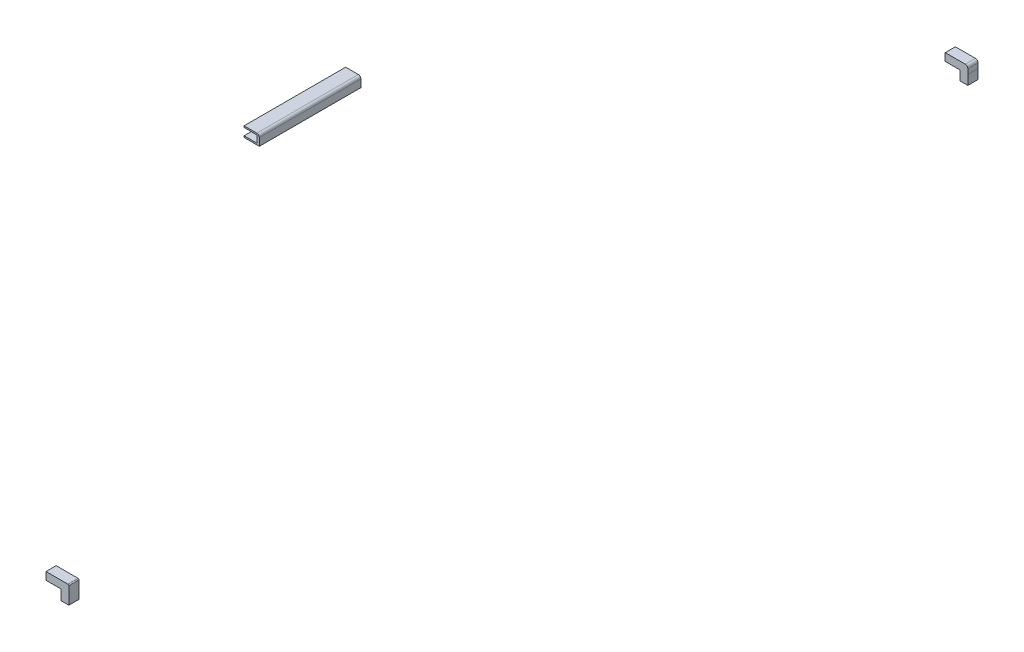
ISO-10303-21;
HEADER;
FILE_DESCRIPTION(('STEP AP214'),'2;1');
FILE_NAME('part.step','',(''),(''),'','','');
FILE_SCHEMA(('AUTOMOTIVE_DESIGN { 1 0 10303 214 1 1 1 1 }'));
ENDSEC;
DATA;
#1=APPLICATION_CONTEXT('core data for automotive mechanical design processes');
#2=APPLICATION_PROTOCOL_DEFINITION('international standard','automotive_design',2000,#1);
#3=PRODUCT_CONTEXT('',#1,'mechanical');
#4=PRODUCT('Part','Part','',(#3));
#5=PRODUCT_RELATED_PRODUCT_CATEGORY('part','',(#4));
#6=PRODUCT_DEFINITION_FORMATION('','',#4);
#7=PRODUCT_DEFINITION_CONTEXT('part definition',#1,'design');
#8=PRODUCT_DEFINITION('design','',#6,#7);
#9=PRODUCT_DEFINITION_SHAPE('','',#8);
#10=(LENGTH_UNIT() NAMED_UNIT(*) SI_UNIT(.MILLI.,.METRE.));
#11=(NAMED_UNIT(*) PLANE_ANGLE_UNIT() SI_UNIT($,.RADIAN.));
#12=(NAMED_UNIT(*) SI_UNIT($,.STERADIAN.) SOLID_ANGLE_UNIT());
#13=UNCERTAINTY_MEASURE_WITH_UNIT(LENGTH_MEASURE(1.E-05),#10,'distance_accuracy_value','');
#14=(GEOMETRIC_REPRESENTATION_CONTEXT(3) GLOBAL_UNCERTAINTY_ASSIGNED_CONTEXT((#13)) GLOBAL_UNIT_ASSIGNED_CONTEXT((#10,
#11,#12)) REPRESENTATION_CONTEXT('',''));
#15=CARTESIAN_POINT('',(0.,0.,0.));
#16=DIRECTION('',(0.,0.,1.));
#17=DIRECTION('',(1.,0.,0.));
#18=AXIS2_PLACEMENT_3D('',#15,#16,#17);
#19=CARTESIAN_POINT('',(0.,-860.,0.));
#20=DIRECTION('',(0.,1.,0.));
#21=DIRECTION('',(0.,0.,1.));
#22=AXIS2_PLACEMENT_3D('',#19,#20,#21);
#23=PLANE('',#22);
#24=DIRECTION('',(0.,0.,-1.));
#25=VECTOR('',#24,1.);
#26=CARTESIAN_POINT('',(-160.,-860.,950.));
#27=LINE('',#26,#25);
#28=CARTESIAN_POINT('',(-160.,-860.,1050.));
#29=VERTEX_POINT('',#28);
#30=CARTESIAN_POINT('',(-160.,-860.,850.));
#31=VERTEX_POINT('',#30);
#32=EDGE_CURVE('P0_E10',#29,#31,#27,.T.);
#33=ORIENTED_EDGE('',*,*,#32,.F.);
#34=DIRECTION('',(1.,0.,0.));
#35=VECTOR('',#34,1.);
#36=CARTESIAN_POINT('',(-175.,-860.,1050.));
#37=LINE('',#36,#35);
#38=CARTESIAN_POINT('',(-190.,-860.,1050.));
#39=VERTEX_POINT('',#38);
#40=EDGE_CURVE('P0_E132',#39,#29,#37,.T.);
#41=ORIENTED_EDGE('',*,*,#40,.F.);
#42=DIRECTION('',(0.,0.,1.));
#43=VECTOR('',#42,1.);
#44=CARTESIAN_POINT('',(-190.,-860.,950.));
#45=LINE('',#44,#43);
#46=CARTESIAN_POINT('',(-190.,-860.,850.));
#47=VERTEX_POINT('',#46);
#48=EDGE_CURVE('P0_E287',#47,#39,#45,.T.);
#49=ORIENTED_EDGE('',*,*,#48,.F.);
#50=DIRECTION('',(-1.,0.,0.));
#51=VECTOR('',#50,1.);
#52=CARTESIAN_POINT('',(-175.000000000001,-860.,850.));
#53=LINE('',#52,#51);
#54=EDGE_CURVE('P0_E27',#31,#47,#53,.T.);
#55=ORIENTED_EDGE('',*,*,#54,.F.);
#56=EDGE_LOOP('',(#33,#41,#49,#55));
#57=FACE_BOUND('',#56,.T.);
#58=ADVANCED_FACE('P0_F16',(#57),#23,.F.);
#59=CARTESIAN_POINT('',(-190.,-860.,850.));
#60=DIRECTION('',(-1.,0.,0.));
#61=DIRECTION('',(0.,0.,1.));
#62=AXIS2_PLACEMENT_3D('',#59,#60,#61);
#63=PLANE('',#62);
#64=DIRECTION('',(0.,0.,-1.));
#65=VECTOR('',#64,1.);
#66=CARTESIAN_POINT('',(-190.,-857.,950.));
#67=LINE('',#66,#65);
#68=CARTESIAN_POINT('',(-190.,-857.,1050.));
#69=VERTEX_POINT('',#68);
#70=CARTESIAN_POINT('',(-190.,-857.,850.));
#71=VERTEX_POINT('',#70);
#72=EDGE_CURVE('P0_E172',#69,#71,#67,.T.);
#73=ORIENTED_EDGE('',*,*,#72,.T.);
#74=DIRECTION('',(0.,1.,0.));
#75=VECTOR('',#74,1.);
#76=CARTESIAN_POINT('',(-190.,-858.5,850.));
#77=LINE('',#76,#75);
#78=EDGE_CURVE('P0_E188',#47,#71,#77,.T.);
#79=ORIENTED_EDGE('',*,*,#78,.F.);
#80=ORIENTED_EDGE('',*,*,#48,.T.);
#81=DIRECTION('',(0.,1.,0.));
#82=VECTOR('',#81,1.);
#83=CARTESIAN_POINT('',(-190.,-858.5,1050.));
#84=LINE('',#83,#82);
#85=EDGE_CURVE('P0_E123',#39,#69,#84,.T.);
#86=ORIENTED_EDGE('',*,*,#85,.T.);
#87=EDGE_LOOP('',(#73,#79,#80,#86));
#88=FACE_BOUND('',#87,.T.);
#89=ADVANCED_FACE('P0_F200',(#88),#63,.T.);
#90=CARTESIAN_POINT('',(-190.,-860.,850.));
#91=DIRECTION('',(-1.,0.,0.));
#92=DIRECTION('',(0.,0.,1.));
#93=AXIS2_PLACEMENT_3D('',#90,#91,#92);
#94=PLANE('',#93);
#95=DIRECTION('',(0.,0.,-1.));
#96=VECTOR('',#95,1.);
#97=CARTESIAN_POINT('',(-190.,-843.,950.));
#98=LINE('',#97,#96);
#99=CARTESIAN_POINT('',(-190.,-843.,1050.));
#100=VERTEX_POINT('',#99);
#101=CARTESIAN_POINT('',(-190.,-843.,850.));
#102=VERTEX_POINT('',#101);
#103=EDGE_CURVE('P0_E191',#100,#102,#98,.T.);
#104=ORIENTED_EDGE('',*,*,#103,.F.);
#105=DIRECTION('',(0.,1.,0.));
#106=VECTOR('',#105,1.);
#107=CARTESIAN_POINT('',(-190.,-841.5,1050.));
#108=LINE('',#107,#106);
#109=CARTESIAN_POINT('',(-190.,-840.,1050.));
#110=VERTEX_POINT('',#109);
#111=EDGE_CURVE('P0_E126',#100,#110,#108,.T.);
#112=ORIENTED_EDGE('',*,*,#111,.T.);
#113=DIRECTION('',(0.,0.,1.));
#114=VECTOR('',#113,1.);
#115=CARTESIAN_POINT('',(-190.,-840.,950.));
#116=LINE('',#115,#114);
#117=CARTESIAN_POINT('',(-190.,-840.,850.));
#118=VERTEX_POINT('',#117);
#119=EDGE_CURVE('P0_E167',#118,#110,#116,.T.);
#120=ORIENTED_EDGE('',*,*,#119,.F.);
#121=DIRECTION('',(0.,1.,0.));
#122=VECTOR('',#121,1.);
#123=CARTESIAN_POINT('',(-190.,-841.5,850.));
#124=LINE('',#123,#122);
#125=EDGE_CURVE('P0_E103',#102,#118,#124,.T.);
#126=ORIENTED_EDGE('',*,*,#125,.F.);
#127=EDGE_LOOP('',(#104,#112,#120,#126));
#128=FACE_BOUND('',#127,.T.);
#129=ADVANCED_FACE('P0_F194',(#128),#94,.T.);
#130=CARTESIAN_POINT('',(-165.,-857.,1050.));
#131=DIRECTION('',(0.,-1.,0.));
#132=DIRECTION('',(0.,0.,-1.));
#133=AXIS2_PLACEMENT_3D('',#130,#131,#132);
#134=PLANE('',#133);
#135=DIRECTION('',(1.,0.,0.));
#136=VECTOR('',#135,1.);
#137=CARTESIAN_POINT('',(-177.5,-857.,850.));
#138=LINE('',#137,#136);
#139=CARTESIAN_POINT('',(-165.,-857.,850.));
#140=VERTEX_POINT('',#139);
#141=EDGE_CURVE('P0_E169',#71,#140,#138,.T.);
#142=ORIENTED_EDGE('',*,*,#141,.F.);
#143=ORIENTED_EDGE('',*,*,#72,.F.);
#144=DIRECTION('',(1.,0.,0.));
#145=VECTOR('',#144,1.);
#146=CARTESIAN_POINT('',(-177.5,-857.,1050.));
#147=LINE('',#146,#145);
#148=CARTESIAN_POINT('',(-165.,-857.,1050.));
#149=VERTEX_POINT('',#148);
#150=EDGE_CURVE('P0_E153',#69,#149,#147,.T.);
#151=ORIENTED_EDGE('',*,*,#150,.T.);
#152=DIRECTION('',(0.,0.,-1.));
#153=VECTOR('',#152,1.);
#154=CARTESIAN_POINT('',(-165.,-857.,950.));
#155=LINE('',#154,#153);
#156=EDGE_CURVE('P0_E146',#149,#140,#155,.T.);
#157=ORIENTED_EDGE('',*,*,#156,.T.);
#158=EDGE_LOOP('',(#142,#143,#151,#157));
#159=FACE_BOUND('',#158,.T.);
#160=ADVANCED_FACE('P0_F201',(#159),#134,.F.);
#161=CARTESIAN_POINT('',(-165.,-857.,1050.));
#162=DIRECTION('',(-1.,0.,0.));
#163=DIRECTION('',(0.,0.,1.));
#164=AXIS2_PLACEMENT_3D('',#161,#162,#163);
#165=PLANE('',#164);
#166=DIRECTION('',(0.,1.,0.));
#167=VECTOR('',#166,1.);
#168=CARTESIAN_POINT('',(-165.,-850.,850.));
#169=LINE('',#168,#167);
#170=CARTESIAN_POINT('',(-165.,-843.,850.));
#171=VERTEX_POINT('',#170);
#172=EDGE_CURVE('P0_E150',#140,#171,#169,.T.);
#173=ORIENTED_EDGE('',*,*,#172,.F.);
#174=ORIENTED_EDGE('',*,*,#156,.F.);
#175=DIRECTION('',(0.,1.,0.));
#176=VECTOR('',#175,1.);
#177=CARTESIAN_POINT('',(-165.,-850.,1050.));
#178=LINE('',#177,#176);
#179=CARTESIAN_POINT('',(-165.,-843.,1050.));
#180=VERTEX_POINT('',#179);
#181=EDGE_CURVE('P0_E152',#149,#180,#178,.T.);
#182=ORIENTED_EDGE('',*,*,#181,.T.);
#183=DIRECTION('',(0.,0.,-1.));
#184=VECTOR('',#183,1.);
#185=CARTESIAN_POINT('',(-165.,-843.,950.));
#186=LINE('',#185,#184);
#187=EDGE_CURVE('P0_E134',#180,#171,#186,.T.);
#188=ORIENTED_EDGE('',*,*,#187,.T.);
#189=EDGE_LOOP('',(#173,#174,#182,#188));
#190=FACE_BOUND('',#189,.T.);
#191=ADVANCED_FACE('P0_F203',(#190),#165,.T.);
#192=CARTESIAN_POINT('',(-190.,-843.,1050.));
#193=DIRECTION('',(0.,1.,0.));
#194=DIRECTION('',(0.,0.,1.));
#195=AXIS2_PLACEMENT_3D('',#192,#193,#194);
#196=PLANE('',#195);
#197=DIRECTION('',(-1.,0.,0.));
#198=VECTOR('',#197,1.);
#199=CARTESIAN_POINT('',(-177.5,-843.,850.));
#200=LINE('',#199,#198);
#201=EDGE_CURVE('P0_E137',#171,#102,#200,.T.);
#202=ORIENTED_EDGE('',*,*,#201,.F.);
#203=ORIENTED_EDGE('',*,*,#187,.F.);
#204=DIRECTION('',(-1.,0.,0.));
#205=VECTOR('',#204,1.);
#206=CARTESIAN_POINT('',(-177.5,-843.,1050.));
#207=LINE('',#206,#205);
#208=EDGE_CURVE('P0_E154',#180,#100,#207,.T.);
#209=ORIENTED_EDGE('',*,*,#208,.T.);
#210=ORIENTED_EDGE('',*,*,#103,.T.);
#211=EDGE_LOOP('',(#202,#203,#209,#210));
#212=FACE_BOUND('',#211,.T.);
#213=ADVANCED_FACE('P0_F196',(#212),#196,.F.);
#214=CARTESIAN_POINT('',(-160.,-860.,1050.));
#215=DIRECTION('',(1.,0.,0.));
#216=DIRECTION('',(0.,0.,-1.));
#217=AXIS2_PLACEMENT_3D('',#214,#215,#216);
#218=PLANE('',#217);
#219=DIRECTION('',(0.,0.,-1.));
#220=VECTOR('',#219,1.);
#221=CARTESIAN_POINT('',(-160.,-845.,950.));
#222=LINE('',#221,#220);
#223=CARTESIAN_POINT('',(-160.,-845.,1050.));
#224=VERTEX_POINT('',#223);
#225=CARTESIAN_POINT('',(-160.,-845.,850.));
#226=VERTEX_POINT('',#225);
#227=EDGE_CURVE('P0_E110',#224,#226,#222,.T.);
#228=ORIENTED_EDGE('',*,*,#227,.F.);
#229=DIRECTION('',(0.,1.,0.));
#230=VECTOR('',#229,1.);
#231=CARTESIAN_POINT('',(-160.,-852.5,1050.));
#232=LINE('',#231,#230);
#233=EDGE_CURVE('P0_E122',#29,#224,#232,.T.);
#234=ORIENTED_EDGE('',*,*,#233,.F.);
#235=ORIENTED_EDGE('',*,*,#32,.T.);
#236=DIRECTION('',(0.,1.,0.));
#237=VECTOR('',#236,1.);
#238=CARTESIAN_POINT('',(-160.,-852.5,850.));
#239=LINE('',#238,#237);
#240=EDGE_CURVE('P0_E106',#31,#226,#239,.T.);
#241=ORIENTED_EDGE('',*,*,#240,.T.);
#242=EDGE_LOOP('',(#228,#234,#235,#241));
#243=FACE_BOUND('',#242,.T.);
#244=ADVANCED_FACE('P0_F133',(#243),#218,.T.);
#245=CARTESIAN_POINT('',(0.,-840.,0.));
#246=DIRECTION('',(0.,1.,0.));
#247=DIRECTION('',(0.,0.,1.));
#248=AXIS2_PLACEMENT_3D('',#245,#246,#247);
#249=PLANE('',#248);
#250=DIRECTION('',(0.,0.,-1.));
#251=VECTOR('',#250,1.);
#252=CARTESIAN_POINT('',(-165.,-840.,950.));
#253=LINE('',#252,#251);
#254=CARTESIAN_POINT('',(-165.,-840.,1050.));
#255=VERTEX_POINT('',#254);
#256=CARTESIAN_POINT('',(-165.,-840.,850.));
#257=VERTEX_POINT('',#256);
#258=EDGE_CURVE('P0_E84',#255,#257,#253,.T.);
#259=ORIENTED_EDGE('',*,*,#258,.T.);
#260=DIRECTION('',(-1.,0.,0.));
#261=VECTOR('',#260,1.);
#262=CARTESIAN_POINT('',(-177.5,-840.,850.));
#263=LINE('',#262,#261);
#264=EDGE_CURVE('P0_E91',#257,#118,#263,.T.);
#265=ORIENTED_EDGE('',*,*,#264,.T.);
#266=ORIENTED_EDGE('',*,*,#119,.T.);
#267=DIRECTION('',(1.,0.,0.));
#268=VECTOR('',#267,1.);
#269=CARTESIAN_POINT('',(-177.5,-840.,1050.));
#270=LINE('',#269,#268);
#271=EDGE_CURVE('P0_E93',#110,#255,#270,.T.);
#272=ORIENTED_EDGE('',*,*,#271,.T.);
#273=EDGE_LOOP('',(#259,#265,#266,#272));
#274=FACE_BOUND('',#273,.T.);
#275=ADVANCED_FACE('P0_F89',(#274),#249,.T.);
#276=CARTESIAN_POINT('',(-160.,-860.,1050.));
#277=DIRECTION('',(0.,0.,-1.));
#278=DIRECTION('',(-1.,0.,0.));
#279=AXIS2_PLACEMENT_3D('',#276,#277,#278);
#280=PLANE('',#279);
#281=ORIENTED_EDGE('',*,*,#233,.T.);
#282=CARTESIAN_POINT('',(-165.,-845.,1050.));
#283=DIRECTION('',(0.,0.,-1.));
#284=DIRECTION('',(-1.,0.,0.));
#285=AXIS2_PLACEMENT_3D('',#282,#283,#284);
#286=CIRCLE('',#285,5.);
#287=EDGE_CURVE('P0_E105',#255,#224,#286,.T.);
#288=ORIENTED_EDGE('',*,*,#287,.F.);
#289=ORIENTED_EDGE('',*,*,#271,.F.);
#290=ORIENTED_EDGE('',*,*,#111,.F.);
#291=ORIENTED_EDGE('',*,*,#208,.F.);
#292=ORIENTED_EDGE('',*,*,#181,.F.);
#293=ORIENTED_EDGE('',*,*,#150,.F.);
#294=ORIENTED_EDGE('',*,*,#85,.F.);
#295=ORIENTED_EDGE('',*,*,#40,.T.);
#296=EDGE_LOOP('',(#281,#288,#289,#290,#291,#292,#293,#294,#295));
#297=FACE_BOUND('',#296,.T.);
#298=ADVANCED_FACE('P0_F128',(#297),#280,.F.);
#299=CARTESIAN_POINT('',(-190.,-860.,850.));
#300=DIRECTION('',(0.,0.,1.));
#301=DIRECTION('',(1.,0.,0.));
#302=AXIS2_PLACEMENT_3D('',#299,#300,#301);
#303=PLANE('',#302);
#304=ORIENTED_EDGE('',*,*,#264,.F.);
#305=CARTESIAN_POINT('',(-165.,-845.,850.));
#306=DIRECTION('',(0.,0.,1.));
#307=DIRECTION('',(1.,0.,0.));
#308=AXIS2_PLACEMENT_3D('',#305,#306,#307);
#309=CIRCLE('',#308,5.);
#310=EDGE_CURVE('P0_E20',#226,#257,#309,.T.);
#311=ORIENTED_EDGE('',*,*,#310,.F.);
#312=ORIENTED_EDGE('',*,*,#240,.F.);
#313=ORIENTED_EDGE('',*,*,#54,.T.);
#314=ORIENTED_EDGE('',*,*,#78,.T.);
#315=ORIENTED_EDGE('',*,*,#141,.T.);
#316=ORIENTED_EDGE('',*,*,#172,.T.);
#317=ORIENTED_EDGE('',*,*,#201,.T.);
#318=ORIENTED_EDGE('',*,*,#125,.T.);
#319=EDGE_LOOP('',(#304,#311,#312,#313,#314,#315,#316,#317,#318));
#320=FACE_BOUND('',#319,.T.);
#321=ADVANCED_FACE('P0_F100',(#320),#303,.F.);
#322=CARTESIAN_POINT('',(-165.,-845.,950.));
#323=DIRECTION('',(0.,0.,1.));
#324=DIRECTION('',(1.,0.,0.));
#325=AXIS2_PLACEMENT_3D('',#322,#323,#324);
#326=CYLINDRICAL_SURFACE('',#325,5.);
#327=ORIENTED_EDGE('',*,*,#227,.T.);
#328=ORIENTED_EDGE('',*,*,#310,.T.);
#329=ORIENTED_EDGE('',*,*,#258,.F.);
#330=ORIENTED_EDGE('',*,*,#287,.T.);
#331=EDGE_LOOP('',(#327,#328,#329,#330));
#332=FACE_BOUND('',#331,.T.);
#333=ADVANCED_FACE('P0_F18',(#332),#326,.T.);
#334=CLOSED_SHELL('',(#58,#89,#129,#160,#191,#213,#244,#275,#298,#321,#333));
#335=MANIFOLD_SOLID_BREP('P0_B1',#334);
#336=CARTESIAN_POINT('',(400.,0.,0.));
#337=DIRECTION('',(1.,0.,0.));
#338=DIRECTION('',(0.,0.,-1.));
#339=AXIS2_PLACEMENT_3D('',#336,#337,#338);
#340=PLANE('',#339);
#341=DIRECTION('',(0.,0.,-1.));
#342=VECTOR('',#341,1.);
#343=CARTESIAN_POINT('',(400.,-880.,1990.));
#344=LINE('',#343,#342);
#345=CARTESIAN_POINT('',(400.,-880.,2000.));
#346=VERTEX_POINT('',#345);
#347=CARTESIAN_POINT('',(400.,-880.,1980.));
#348=VERTEX_POINT('',#347);
#349=EDGE_CURVE('P1_E11',#346,#348,#344,.T.);
#350=ORIENTED_EDGE('',*,*,#349,.F.);
#351=DIRECTION('',(0.,-1.,0.));
#352=VECTOR('',#351,1.);
#353=CARTESIAN_POINT('',(400.,-870.,2000.));
#354=LINE('',#353,#352);
#355=CARTESIAN_POINT('',(400.,-860.,2000.));
#356=VERTEX_POINT('',#355);
#357=EDGE_CURVE('P1_E144',#356,#346,#354,.T.);
#358=ORIENTED_EDGE('',*,*,#357,.F.);
#359=DIRECTION('',(0.,0.,1.));
#360=VECTOR('',#359,1.);
#361=CARTESIAN_POINT('',(400.,-860.,1990.));
#362=LINE('',#361,#360);
#363=CARTESIAN_POINT('',(400.,-860.,1980.));
#364=VERTEX_POINT('',#363);
#365=EDGE_CURVE('P1_E148',#364,#356,#362,.T.);
#366=ORIENTED_EDGE('',*,*,#365,.F.);
#367=DIRECTION('',(0.,1.,0.));
#368=VECTOR('',#367,1.);
#369=CARTESIAN_POINT('',(400.,-870.,1980.));
#370=LINE('',#369,#368);
#371=EDGE_CURVE('P1_E28',#348,#364,#370,.T.);
#372=ORIENTED_EDGE('',*,*,#371,.F.);
#373=EDGE_LOOP('',(#350,#358,#366,#372));
#374=FACE_BOUND('',#373,.T.);
#375=ADVANCED_FACE('P1_F17',(#374),#340,.F.);
#376=CARTESIAN_POINT('',(370.,-860.,2000.));
#377=DIRECTION('',(1.,0.,0.));
#378=DIRECTION('',(0.,0.,-1.));
#379=AXIS2_PLACEMENT_3D('',#376,#377,#378);
#380=PLANE('',#379);
#381=DIRECTION('',(0.,0.,1.));
#382=VECTOR('',#381,1.);
#383=CARTESIAN_POINT('',(370.,-845.,1990.));
#384=LINE('',#383,#382);
#385=CARTESIAN_POINT('',(370.,-845.,1980.));
#386=VERTEX_POINT('',#385);
#387=CARTESIAN_POINT('',(370.,-845.,2000.));
#388=VERTEX_POINT('',#387);
#389=EDGE_CURVE('P1_E85',#386,#388,#384,.T.);
#390=ORIENTED_EDGE('',*,*,#389,.F.);
#391=DIRECTION('',(0.,1.,0.));
#392=VECTOR('',#391,1.);
#393=CARTESIAN_POINT('',(370.,-852.5,1980.));
#394=LINE('',#393,#392);
#395=CARTESIAN_POINT('',(370.,-860.,1980.));
#396=VERTEX_POINT('',#395);
#397=EDGE_CURVE('P1_E134',#396,#386,#394,.T.);
#398=ORIENTED_EDGE('',*,*,#397,.F.);
#399=DIRECTION('',(0.,0.,1.));
#400=VECTOR('',#399,1.);
#401=CARTESIAN_POINT('',(370.,-860.,1990.));
#402=LINE('',#401,#400);
#403=CARTESIAN_POINT('',(370.,-860.,2000.));
#404=VERTEX_POINT('',#403);
#405=EDGE_CURVE('P1_E129',#396,#404,#402,.T.);
#406=ORIENTED_EDGE('',*,*,#405,.T.);
#407=DIRECTION('',(0.,1.,0.));
#408=VECTOR('',#407,1.);
#409=CARTESIAN_POINT('',(370.,-852.5,2000.));
#410=LINE('',#409,#408);
#411=EDGE_CURVE('P1_E88',#404,#388,#410,.T.);
#412=ORIENTED_EDGE('',*,*,#411,.T.);
#413=EDGE_LOOP('',(#390,#398,#406,#412));
#414=FACE_BOUND('',#413,.T.);
#415=ADVANCED_FACE('P1_F164',(#414),#380,.F.);
#416=CARTESIAN_POINT('',(0.,-860.,0.));
#417=DIRECTION('',(0.,1.,0.));
#418=DIRECTION('',(0.,0.,1.));
#419=AXIS2_PLACEMENT_3D('',#416,#417,#418);
#420=PLANE('',#419);
#421=DIRECTION('',(-1.,0.,0.));
#422=VECTOR('',#421,1.);
#423=CARTESIAN_POINT('',(385.,-860.,1980.));
#424=LINE('',#423,#422);
#425=EDGE_CURVE('P1_E131',#364,#396,#424,.T.);
#426=ORIENTED_EDGE('',*,*,#425,.F.);
#427=ORIENTED_EDGE('',*,*,#365,.T.);
#428=DIRECTION('',(1.,0.,0.));
#429=VECTOR('',#428,1.);
#430=CARTESIAN_POINT('',(385.,-860.,2000.));
#431=LINE('',#430,#429);
#432=EDGE_CURVE('P1_E125',#404,#356,#431,.T.);
#433=ORIENTED_EDGE('',*,*,#432,.F.);
#434=ORIENTED_EDGE('',*,*,#405,.F.);
#435=EDGE_LOOP('',(#426,#427,#433,#434));
#436=FACE_BOUND('',#435,.T.);
#437=ADVANCED_FACE('P1_F160',(#436),#420,.F.);
#438=CARTESIAN_POINT('',(400.,-880.,2000.));
#439=DIRECTION('',(0.,-1.,0.));
#440=DIRECTION('',(0.,0.,-1.));
#441=AXIS2_PLACEMENT_3D('',#438,#439,#440);
#442=PLANE('',#441);
#443=DIRECTION('',(0.,0.,-1.));
#444=VECTOR('',#443,1.);
#445=CARTESIAN_POINT('',(415.,-880.,1990.));
#446=LINE('',#445,#444);
#447=CARTESIAN_POINT('',(415.,-880.,2000.));
#448=VERTEX_POINT('',#447);
#449=CARTESIAN_POINT('',(415.,-880.,1980.));
#450=VERTEX_POINT('',#449);
#451=EDGE_CURVE('P1_E119',#448,#450,#446,.T.);
#452=ORIENTED_EDGE('',*,*,#451,.F.);
#453=DIRECTION('',(1.,0.,0.));
#454=VECTOR('',#453,1.);
#455=CARTESIAN_POINT('',(407.5,-880.,2000.));
#456=LINE('',#455,#454);
#457=EDGE_CURVE('P1_E116',#346,#448,#456,.T.);
#458=ORIENTED_EDGE('',*,*,#457,.F.);
#459=ORIENTED_EDGE('',*,*,#349,.T.);
#460=DIRECTION('',(1.,0.,0.));
#461=VECTOR('',#460,1.);
#462=CARTESIAN_POINT('',(407.5,-880.,1980.));
#463=LINE('',#462,#461);
#464=EDGE_CURVE('P1_E110',#348,#450,#463,.T.);
#465=ORIENTED_EDGE('',*,*,#464,.T.);
#466=EDGE_LOOP('',(#452,#458,#459,#465));
#467=FACE_BOUND('',#466,.T.);
#468=ADVANCED_FACE('P1_F169',(#467),#442,.T.);
#469=CARTESIAN_POINT('',(415.,-860.,1980.));
#470=DIRECTION('',(0.,0.,-1.));
#471=DIRECTION('',(-1.,0.,0.));
#472=AXIS2_PLACEMENT_3D('',#469,#470,#471);
#473=PLANE('',#472);
#474=CARTESIAN_POINT('',(413.,-847.,1980.));
#475=DIRECTION('',(0.,0.,1.));
#476=DIRECTION('',(-1.,0.,0.));
#477=AXIS2_PLACEMENT_3D('',#474,#475,#476);
#478=CIRCLE('',#477,2.);
#479=CARTESIAN_POINT('',(415.,-847.,1980.));
#480=VERTEX_POINT('',#479);
#481=CARTESIAN_POINT('',(413.,-845.,1980.));
#482=VERTEX_POINT('',#481);
#483=EDGE_CURVE('P1_E98',#480,#482,#478,.T.);
#484=ORIENTED_EDGE('',*,*,#483,.F.);
#485=DIRECTION('',(0.,1.,0.));
#486=VECTOR('',#485,1.);
#487=CARTESIAN_POINT('',(415.,-863.5,1980.));
#488=LINE('',#487,#486);
#489=EDGE_CURVE('P1_E107',#450,#480,#488,.T.);
#490=ORIENTED_EDGE('',*,*,#489,.F.);
#491=ORIENTED_EDGE('',*,*,#464,.F.);
#492=ORIENTED_EDGE('',*,*,#371,.T.);
#493=ORIENTED_EDGE('',*,*,#425,.T.);
#494=ORIENTED_EDGE('',*,*,#397,.T.);
#495=DIRECTION('',(-1.,0.,0.));
#496=VECTOR('',#495,1.);
#497=CARTESIAN_POINT('',(391.5,-845.,1980.));
#498=LINE('',#497,#496);
#499=EDGE_CURVE('P1_E112',#482,#386,#498,.T.);
#500=ORIENTED_EDGE('',*,*,#499,.F.);
#501=EDGE_LOOP('',(#484,#490,#491,#492,#493,#494,#500));
#502=FACE_BOUND('',#501,.T.);
#503=ADVANCED_FACE('P1_F157',(#502),#473,.T.);
#504=CARTESIAN_POINT('',(415.,-860.,1980.));
#505=DIRECTION('',(-1.,0.,0.));
#506=DIRECTION('',(0.,0.,1.));
#507=AXIS2_PLACEMENT_3D('',#504,#505,#506);
#508=PLANE('',#507);
#509=ORIENTED_EDGE('',*,*,#489,.T.);
#510=DIRECTION('',(0.,0.,-1.));
#511=VECTOR('',#510,1.);
#512=CARTESIAN_POINT('',(415.,-847.,1990.));
#513=LINE('',#512,#511);
#514=CARTESIAN_POINT('',(415.,-847.,2000.));
#515=VERTEX_POINT('',#514);
#516=EDGE_CURVE('P1_E72',#515,#480,#513,.T.);
#517=ORIENTED_EDGE('',*,*,#516,.F.);
#518=DIRECTION('',(0.,1.,0.));
#519=VECTOR('',#518,1.);
#520=CARTESIAN_POINT('',(415.,-863.5,2000.));
#521=LINE('',#520,#519);
#522=EDGE_CURVE('P1_E92',#448,#515,#521,.T.);
#523=ORIENTED_EDGE('',*,*,#522,.F.);
#524=ORIENTED_EDGE('',*,*,#451,.T.);
#525=EDGE_LOOP('',(#509,#517,#523,#524));
#526=FACE_BOUND('',#525,.T.);
#527=ADVANCED_FACE('P1_F165',(#526),#508,.F.);
#528=CARTESIAN_POINT('',(370.,-860.,2000.));
#529=DIRECTION('',(0.,0.,1.));
#530=DIRECTION('',(1.,0.,0.));
#531=AXIS2_PLACEMENT_3D('',#528,#529,#530);
#532=PLANE('',#531);
#533=CARTESIAN_POINT('',(413.,-847.,2000.));
#534=DIRECTION('',(0.,0.,-1.));
#535=DIRECTION('',(1.,0.,0.));
#536=AXIS2_PLACEMENT_3D('',#533,#534,#535);
#537=CIRCLE('',#536,2.);
#538=CARTESIAN_POINT('',(413.,-845.,2000.));
#539=VERTEX_POINT('',#538);
#540=EDGE_CURVE('P1_E90',#539,#515,#537,.T.);
#541=ORIENTED_EDGE('',*,*,#540,.F.);
#542=DIRECTION('',(1.,0.,0.));
#543=VECTOR('',#542,1.);
#544=CARTESIAN_POINT('',(391.5,-845.,2000.));
#545=LINE('',#544,#543);
#546=EDGE_CURVE('P1_E79',#388,#539,#545,.T.);
#547=ORIENTED_EDGE('',*,*,#546,.F.);
#548=ORIENTED_EDGE('',*,*,#411,.F.);
#549=ORIENTED_EDGE('',*,*,#432,.T.);
#550=ORIENTED_EDGE('',*,*,#357,.T.);
#551=ORIENTED_EDGE('',*,*,#457,.T.);
#552=ORIENTED_EDGE('',*,*,#522,.T.);
#553=EDGE_LOOP('',(#541,#547,#548,#549,#550,#551,#552));
#554=FACE_BOUND('',#553,.T.);
#555=ADVANCED_FACE('P1_F91',(#554),#532,.T.);
#556=CARTESIAN_POINT('',(0.,-845.,0.));
#557=DIRECTION('',(0.,1.,0.));
#558=DIRECTION('',(0.,0.,1.));
#559=AXIS2_PLACEMENT_3D('',#556,#557,#558);
#560=PLANE('',#559);
#561=DIRECTION('',(0.,0.,-1.));
#562=VECTOR('',#561,1.);
#563=CARTESIAN_POINT('',(413.,-845.,1990.));
#564=LINE('',#563,#562);
#565=EDGE_CURVE('P1_E21',#539,#482,#564,.T.);
#566=ORIENTED_EDGE('',*,*,#565,.T.);
#567=ORIENTED_EDGE('',*,*,#499,.T.);
#568=ORIENTED_EDGE('',*,*,#389,.T.);
#569=ORIENTED_EDGE('',*,*,#546,.T.);
#570=EDGE_LOOP('',(#566,#567,#568,#569));
#571=FACE_BOUND('',#570,.T.);
#572=ADVANCED_FACE('P1_F81',(#571),#560,.T.);
#573=CARTESIAN_POINT('',(413.,-847.,1990.));
#574=DIRECTION('',(0.,0.,1.));
#575=DIRECTION('',(1.,0.,0.));
#576=AXIS2_PLACEMENT_3D('',#573,#574,#575);
#577=CYLINDRICAL_SURFACE('',#576,2.);
#578=ORIENTED_EDGE('',*,*,#516,.T.);
#579=ORIENTED_EDGE('',*,*,#483,.T.);
#580=ORIENTED_EDGE('',*,*,#565,.F.);
#581=ORIENTED_EDGE('',*,*,#540,.T.);
#582=EDGE_LOOP('',(#578,#579,#580,#581));
#583=FACE_BOUND('',#582,.T.);
#584=ADVANCED_FACE('P1_F19',(#583),#577,.T.);
#585=CLOSED_SHELL('',(#375,#415,#437,#468,#503,#527,#555,#572,#584));
#586=MANIFOLD_SOLID_BREP('P1_B1',#585);
#587=CARTESIAN_POINT('',(370.522247314453,-860.,230.000000000001));
#588=DIRECTION('',(1.,0.,0.));
#589=DIRECTION('',(0.,0.,-1.));
#590=AXIS2_PLACEMENT_3D('',#587,#588,#589);
#591=PLANE('',#590);
#592=DIRECTION('',(0.,0.,1.));
#593=VECTOR('',#592,1.);
#594=CARTESIAN_POINT('',(370.522247314453,-845.,220.000000000001));
#595=LINE('',#594,#593);
#596=CARTESIAN_POINT('',(370.522247314453,-845.,210.000000000001));
#597=VERTEX_POINT('',#596);
#598=CARTESIAN_POINT('',(370.522247314453,-845.,230.000000000001));
#599=VERTEX_POINT('',#598);
#600=EDGE_CURVE('P2_E10',#597,#599,#595,.T.);
#601=ORIENTED_EDGE('',*,*,#600,.F.);
#602=DIRECTION('',(0.,1.,0.));
#603=VECTOR('',#602,1.);
#604=CARTESIAN_POINT('',(370.522247314453,-852.5,210.000000000001));
#605=LINE('',#604,#603);
#606=CARTESIAN_POINT('',(370.522247314453,-860.,210.000000000001));
#607=VERTEX_POINT('',#606);
#608=EDGE_CURVE('P2_E27',#607,#597,#605,.T.);
#609=ORIENTED_EDGE('',*,*,#608,.F.);
#610=DIRECTION('',(0.,0.,1.));
#611=VECTOR('',#610,1.);
#612=CARTESIAN_POINT('',(370.522247314453,-860.,220.000000000001));
#613=LINE('',#612,#611);
#614=CARTESIAN_POINT('',(370.522247314453,-860.,230.000000000001));
#615=VERTEX_POINT('',#614);
#616=EDGE_CURVE('P2_E175',#607,#615,#613,.T.);
#617=ORIENTED_EDGE('',*,*,#616,.T.);
#618=DIRECTION('',(0.,1.,0.));
#619=VECTOR('',#618,1.);
#620=CARTESIAN_POINT('',(370.522247314453,-852.5,230.000000000001));
#621=LINE('',#620,#619);
#622=EDGE_CURVE('P2_E36',#615,#599,#621,.T.);
#623=ORIENTED_EDGE('',*,*,#622,.T.);
#624=EDGE_LOOP('',(#601,#609,#617,#623));
#625=FACE_BOUND('',#624,.T.);
#626=ADVANCED_FACE('P2_F16',(#625),#591,.F.);
#627=CARTESIAN_POINT('',(0.,-860.,0.));
#628=DIRECTION('',(0.,1.,0.));
#629=DIRECTION('',(0.,0.,1.));
#630=AXIS2_PLACEMENT_3D('',#627,#628,#629);
#631=PLANE('',#630);
#632=DIRECTION('',(-1.,0.,0.));
#633=VECTOR('',#632,1.);
#634=CARTESIAN_POINT('',(385.261123657226,-860.,210.));
#635=LINE('',#634,#633);
#636=CARTESIAN_POINT('',(400.,-860.,210.));
#637=VERTEX_POINT('',#636);
#638=EDGE_CURVE('P2_E176',#637,#607,#635,.T.);
#639=ORIENTED_EDGE('',*,*,#638,.F.);
#640=DIRECTION('',(0.,0.,-1.));
#641=VECTOR('',#640,1.);
#642=CARTESIAN_POINT('',(400.,-860.,220.));
#643=LINE('',#642,#641);
#644=CARTESIAN_POINT('',(400.,-860.,230.));
#645=VERTEX_POINT('',#644);
#646=EDGE_CURVE('P2_E168',#645,#637,#643,.T.);
#647=ORIENTED_EDGE('',*,*,#646,.F.);
#648=DIRECTION('',(1.,0.,0.));
#649=VECTOR('',#648,1.);
#650=CARTESIAN_POINT('',(385.261123657227,-860.,230.));
#651=LINE('',#650,#649);
#652=EDGE_CURVE('P2_E171',#615,#645,#651,.T.);
#653=ORIENTED_EDGE('',*,*,#652,.F.);
#654=ORIENTED_EDGE('',*,*,#616,.F.);
#655=EDGE_LOOP('',(#639,#647,#653,#654));
#656=FACE_BOUND('',#655,.T.);
#657=ADVANCED_FACE('P2_F192',(#656),#631,.F.);
#658=CARTESIAN_POINT('',(0.,-860.,0.));
#659=DIRECTION('',(0.,1.,0.));
#660=DIRECTION('',(0.,0.,1.));
#661=AXIS2_PLACEMENT_3D('',#658,#659,#660);
#662=PLANE('',#661);
#663=DIRECTION('',(1.,0.,0.));
#664=VECTOR('',#663,1.);
#665=CARTESIAN_POINT('',(415.011123657227,-860.,230.));
#666=LINE('',#665,#664);
#667=CARTESIAN_POINT('',(415.,-860.,230.));
#668=VERTEX_POINT('',#667);
#669=CARTESIAN_POINT('',(415.022247314453,-860.,230.));
#670=VERTEX_POINT('',#669);
#671=EDGE_CURVE('P2_E106',#668,#670,#666,.T.);
#672=ORIENTED_EDGE('',*,*,#671,.F.);
#673=DIRECTION('',(0.,0.,-1.));
#674=VECTOR('',#673,1.);
#675=CARTESIAN_POINT('',(415.,-860.,220.));
#676=LINE('',#675,#674);
#677=CARTESIAN_POINT('',(415.,-860.,210.));
#678=VERTEX_POINT('',#677);
#679=EDGE_CURVE('P2_E108',#668,#678,#676,.T.);
#680=ORIENTED_EDGE('',*,*,#679,.T.);
#681=DIRECTION('',(-1.,0.,0.));
#682=VECTOR('',#681,1.);
#683=CARTESIAN_POINT('',(415.011123657227,-860.,210.));
#684=LINE('',#683,#682);
#685=CARTESIAN_POINT('',(415.022247314453,-860.,210.));
#686=VERTEX_POINT('',#685);
#687=EDGE_CURVE('P2_E157',#686,#678,#684,.T.);
#688=ORIENTED_EDGE('',*,*,#687,.F.);
#689=DIRECTION('',(0.,0.,-1.));
#690=VECTOR('',#689,1.);
#691=CARTESIAN_POINT('',(415.022247314453,-860.,220.));
#692=LINE('',#691,#690);
#693=EDGE_CURVE('P2_E163',#670,#686,#692,.T.);
#694=ORIENTED_EDGE('',*,*,#693,.F.);
#695=EDGE_LOOP('',(#672,#680,#688,#694));
#696=FACE_BOUND('',#695,.T.);
#697=ADVANCED_FACE('P2_F205',(#696),#662,.F.);
#698=CARTESIAN_POINT('',(400.,-878.701238653977,230.000000000001));
#699=DIRECTION('',(0.,-1.,0.));
#700=DIRECTION('',(0.,0.,-1.));
#701=AXIS2_PLACEMENT_3D('',#698,#699,#700);
#702=PLANE('',#701);
#703=DIRECTION('',(0.,0.,-1.));
#704=VECTOR('',#703,1.);
#705=CARTESIAN_POINT('',(415.,-878.701238653977,220.));
#706=LINE('',#705,#704);
#707=CARTESIAN_POINT('',(415.,-878.701238653977,230.));
#708=VERTEX_POINT('',#707);
#709=CARTESIAN_POINT('',(415.,-878.701238653977,210.));
#710=VERTEX_POINT('',#709);
#711=EDGE_CURVE('P2_E148',#708,#710,#706,.T.);
#712=ORIENTED_EDGE('',*,*,#711,.F.);
#713=DIRECTION('',(1.,0.,0.));
#714=VECTOR('',#713,1.);
#715=CARTESIAN_POINT('',(407.5,-878.701238653977,230.000000000001));
#716=LINE('',#715,#714);
#717=CARTESIAN_POINT('',(400.,-878.701238653977,230.));
#718=VERTEX_POINT('',#717);
#719=EDGE_CURVE('P2_E145',#718,#708,#716,.T.);
#720=ORIENTED_EDGE('',*,*,#719,.F.);
#721=DIRECTION('',(0.,0.,-1.));
#722=VECTOR('',#721,1.);
#723=CARTESIAN_POINT('',(400.,-878.701238653977,220.));
#724=LINE('',#723,#722);
#725=CARTESIAN_POINT('',(400.,-878.701238653977,210.));
#726=VERTEX_POINT('',#725);
#727=EDGE_CURVE('P2_E140',#718,#726,#724,.T.);
#728=ORIENTED_EDGE('',*,*,#727,.T.);
#729=DIRECTION('',(1.,0.,0.));
#730=VECTOR('',#729,1.);
#731=CARTESIAN_POINT('',(407.5,-878.701238653977,210.));
#732=LINE('',#731,#730);
#733=EDGE_CURVE('P2_E127',#726,#710,#732,.T.);
#734=ORIENTED_EDGE('',*,*,#733,.T.);
#735=EDGE_LOOP('',(#712,#720,#728,#734));
#736=FACE_BOUND('',#735,.T.);
#737=ADVANCED_FACE('P2_F200',(#736),#702,.T.);
#738=CARTESIAN_POINT('',(400.,0.,0.));
#739=DIRECTION('',(1.,0.,0.));
#740=DIRECTION('',(0.,0.,-1.));
#741=AXIS2_PLACEMENT_3D('',#738,#739,#740);
#742=PLANE('',#741);
#743=DIRECTION('',(0.,-1.,0.));
#744=VECTOR('',#743,1.);
#745=CARTESIAN_POINT('',(400.,-869.350619326988,230.));
#746=LINE('',#745,#744);
#747=EDGE_CURVE('P2_E141',#645,#718,#746,.T.);
#748=ORIENTED_EDGE('',*,*,#747,.F.);
#749=ORIENTED_EDGE('',*,*,#646,.T.);
#750=DIRECTION('',(0.,1.,0.));
#751=VECTOR('',#750,1.);
#752=CARTESIAN_POINT('',(400.,-869.350619326988,210.));
#753=LINE('',#752,#751);
#754=EDGE_CURVE('P2_E136',#726,#637,#753,.T.);
#755=ORIENTED_EDGE('',*,*,#754,.F.);
#756=ORIENTED_EDGE('',*,*,#727,.F.);
#757=EDGE_LOOP('',(#748,#749,#755,#756));
#758=FACE_BOUND('',#757,.T.);
#759=ADVANCED_FACE('P2_F195',(#758),#742,.F.);
#760=CARTESIAN_POINT('',(415.,-860.,1980.));
#761=DIRECTION('',(-1.,0.,0.));
#762=DIRECTION('',(0.,0.,1.));
#763=AXIS2_PLACEMENT_3D('',#760,#761,#762);
#764=PLANE('',#763);
#765=DIRECTION('',(0.,1.,0.));
#766=VECTOR('',#765,1.);
#767=CARTESIAN_POINT('',(415.,-869.350619326988,210.));
#768=LINE('',#767,#766);
#769=EDGE_CURVE('P2_E122',#710,#678,#768,.T.);
#770=ORIENTED_EDGE('',*,*,#769,.T.);
#771=ORIENTED_EDGE('',*,*,#679,.F.);
#772=DIRECTION('',(0.,-1.,0.));
#773=VECTOR('',#772,1.);
#774=CARTESIAN_POINT('',(415.,-869.350619326988,230.));
#775=LINE('',#774,#773);
#776=EDGE_CURVE('P2_E113',#668,#708,#775,.T.);
#777=ORIENTED_EDGE('',*,*,#776,.T.);
#778=ORIENTED_EDGE('',*,*,#711,.T.);
#779=EDGE_LOOP('',(#770,#771,#777,#778));
#780=FACE_BOUND('',#779,.T.);
#781=ADVANCED_FACE('P2_F202',(#780),#764,.F.);
#782=CARTESIAN_POINT('',(0.,-845.,0.));
#783=DIRECTION('',(0.,1.,0.));
#784=DIRECTION('',(0.,0.,1.));
#785=AXIS2_PLACEMENT_3D('',#782,#783,#784);
#786=PLANE('',#785);
#787=DIRECTION('',(0.,0.,-1.));
#788=VECTOR('',#787,1.);
#789=CARTESIAN_POINT('',(410.022247314453,-845.,220.));
#790=LINE('',#789,#788);
#791=CARTESIAN_POINT('',(410.022247314453,-845.,230.));
#792=VERTEX_POINT('',#791);
#793=CARTESIAN_POINT('',(410.022247314453,-845.,210.));
#794=VERTEX_POINT('',#793);
#795=EDGE_CURVE('P2_E110',#792,#794,#790,.T.);
#796=ORIENTED_EDGE('',*,*,#795,.T.);
#797=DIRECTION('',(-1.,0.,0.));
#798=VECTOR('',#797,1.);
#799=CARTESIAN_POINT('',(390.272247314453,-845.,210.));
#800=LINE('',#799,#798);
#801=EDGE_CURVE('P2_E123',#794,#597,#800,.T.);
#802=ORIENTED_EDGE('',*,*,#801,.T.);
#803=ORIENTED_EDGE('',*,*,#600,.T.);
#804=DIRECTION('',(1.,0.,0.));
#805=VECTOR('',#804,1.);
#806=CARTESIAN_POINT('',(390.272247314453,-845.,230.));
#807=LINE('',#806,#805);
#808=EDGE_CURVE('P2_E128',#599,#792,#807,.T.);
#809=ORIENTED_EDGE('',*,*,#808,.T.);
#810=EDGE_LOOP('',(#796,#802,#803,#809));
#811=FACE_BOUND('',#810,.T.);
#812=ADVANCED_FACE('P2_F210',(#811),#786,.T.);
#813=CARTESIAN_POINT('',(415.022247314453,-860.,210.));
#814=DIRECTION('',(-1.,0.,0.));
#815=DIRECTION('',(0.,0.,1.));
#816=AXIS2_PLACEMENT_3D('',#813,#814,#815);
#817=PLANE('',#816);
#818=DIRECTION('',(0.,1.,0.));
#819=VECTOR('',#818,1.);
#820=CARTESIAN_POINT('',(415.022247314453,-855.,210.));
#821=LINE('',#820,#819);
#822=CARTESIAN_POINT('',(415.022247314453,-850.,210.));
#823=VERTEX_POINT('',#822);
#824=EDGE_CURVE('P2_E85',#686,#823,#821,.T.);
#825=ORIENTED_EDGE('',*,*,#824,.T.);
#826=DIRECTION('',(0.,0.,-1.));
#827=VECTOR('',#826,1.);
#828=CARTESIAN_POINT('',(415.022247314453,-850.,220.));
#829=LINE('',#828,#827);
#830=CARTESIAN_POINT('',(415.022247314453,-850.,230.));
#831=VERTEX_POINT('',#830);
#832=EDGE_CURVE('P2_E88',#831,#823,#829,.T.);
#833=ORIENTED_EDGE('',*,*,#832,.F.);
#834=DIRECTION('',(0.,1.,0.));
#835=VECTOR('',#834,1.);
#836=CARTESIAN_POINT('',(415.022247314453,-855.,230.));
#837=LINE('',#836,#835);
#838=EDGE_CURVE('P2_E91',#670,#831,#837,.T.);
#839=ORIENTED_EDGE('',*,*,#838,.F.);
#840=ORIENTED_EDGE('',*,*,#693,.T.);
#841=EDGE_LOOP('',(#825,#833,#839,#840));
#842=FACE_BOUND('',#841,.T.);
#843=ADVANCED_FACE('P2_F90',(#842),#817,.F.);
#844=CARTESIAN_POINT('',(370.522247314453,-860.,230.));
#845=DIRECTION('',(0.,0.,1.));
#846=DIRECTION('',(1.,0.,0.));
#847=AXIS2_PLACEMENT_3D('',#844,#845,#846);
#848=PLANE('',#847);
#849=CARTESIAN_POINT('',(410.022247314453,-850.,230.));
#850=DIRECTION('',(0.,0.,-1.));
#851=DIRECTION('',(1.,0.,0.));
#852=AXIS2_PLACEMENT_3D('',#849,#850,#851);
#853=CIRCLE('',#852,5.);
#854=EDGE_CURVE('P2_E97',#792,#831,#853,.T.);
#855=ORIENTED_EDGE('',*,*,#854,.F.);
#856=ORIENTED_EDGE('',*,*,#808,.F.);
#857=ORIENTED_EDGE('',*,*,#622,.F.);
#858=ORIENTED_EDGE('',*,*,#652,.T.);
#859=ORIENTED_EDGE('',*,*,#747,.T.);
#860=ORIENTED_EDGE('',*,*,#719,.T.);
#861=ORIENTED_EDGE('',*,*,#776,.F.);
#862=ORIENTED_EDGE('',*,*,#671,.T.);
#863=ORIENTED_EDGE('',*,*,#838,.T.);
#864=EDGE_LOOP('',(#855,#856,#857,#858,#859,#860,#861,#862,#863));
#865=FACE_BOUND('',#864,.T.);
#866=ADVANCED_FACE('P2_F102',(#865),#848,.T.);
#867=CARTESIAN_POINT('',(415.022247314453,-860.,210.));
#868=DIRECTION('',(0.,0.,-1.));
#869=DIRECTION('',(-1.,0.,0.));
#870=AXIS2_PLACEMENT_3D('',#867,#868,#869);
#871=PLANE('',#870);
#872=CARTESIAN_POINT('',(410.022247314453,-850.,210.));
#873=DIRECTION('',(0.,0.,1.));
#874=DIRECTION('',(-1.,0.,0.));
#875=AXIS2_PLACEMENT_3D('',#872,#873,#874);
#876=CIRCLE('',#875,5.);
#877=EDGE_CURVE('P2_E20',#823,#794,#876,.T.);
#878=ORIENTED_EDGE('',*,*,#877,.F.);
#879=ORIENTED_EDGE('',*,*,#824,.F.);
#880=ORIENTED_EDGE('',*,*,#687,.T.);
#881=ORIENTED_EDGE('',*,*,#769,.F.);
#882=ORIENTED_EDGE('',*,*,#733,.F.);
#883=ORIENTED_EDGE('',*,*,#754,.T.);
#884=ORIENTED_EDGE('',*,*,#638,.T.);
#885=ORIENTED_EDGE('',*,*,#608,.T.);
#886=ORIENTED_EDGE('',*,*,#801,.F.);
#887=EDGE_LOOP('',(#878,#879,#880,#881,#882,#883,#884,#885,#886));
#888=FACE_BOUND('',#887,.T.);
#889=ADVANCED_FACE('P2_F207',(#888),#871,.T.);
#890=CARTESIAN_POINT('',(410.022247314453,-850.,220.));
#891=DIRECTION('',(0.,0.,1.));
#892=DIRECTION('',(1.,0.,0.));
#893=AXIS2_PLACEMENT_3D('',#890,#891,#892);
#894=CYLINDRICAL_SURFACE('',#893,5.);
#895=ORIENTED_EDGE('',*,*,#832,.T.);
#896=ORIENTED_EDGE('',*,*,#877,.T.);
#897=ORIENTED_EDGE('',*,*,#795,.F.);
#898=ORIENTED_EDGE('',*,*,#854,.T.);
#899=EDGE_LOOP('',(#895,#896,#897,#898));
#900=FACE_BOUND('',#899,.T.);
#901=ADVANCED_FACE('P2_F18',(#900),#894,.T.);
#902=CLOSED_SHELL('',(#626,#657,#697,#737,#759,#781,#812,#843,#866,#889,#901));
#903=MANIFOLD_SOLID_BREP('P2_B1',#902);
#904=ADVANCED_BREP_SHAPE_REPRESENTATION('',(#18,#335,#586,#903),#14);
#905=SHAPE_DEFINITION_REPRESENTATION(#9,#904);
ENDSEC;
END-ISO-10303-21;
